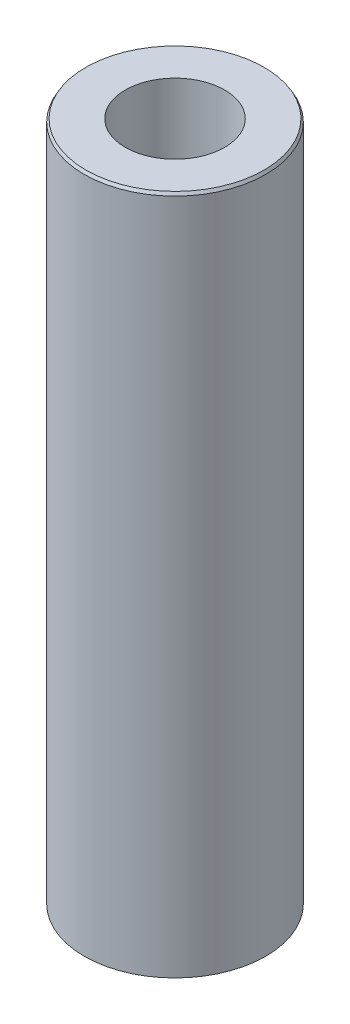
ISO-10303-21;
HEADER;
FILE_DESCRIPTION(('STEP AP214'),'2;1');
FILE_NAME('part.step','',(''),(''),'','','');
FILE_SCHEMA(('AUTOMOTIVE_DESIGN { 1 0 10303 214 1 1 1 1 }'));
ENDSEC;
DATA;
#1=APPLICATION_CONTEXT('core data for automotive mechanical design processes');
#2=APPLICATION_PROTOCOL_DEFINITION('international standard','automotive_design',2000,#1);
#3=PRODUCT_CONTEXT('',#1,'mechanical');
#4=PRODUCT('Part','Part','',(#3));
#5=PRODUCT_RELATED_PRODUCT_CATEGORY('part','',(#4));
#6=PRODUCT_DEFINITION_FORMATION('','',#4);
#7=PRODUCT_DEFINITION_CONTEXT('part definition',#1,'design');
#8=PRODUCT_DEFINITION('design','',#6,#7);
#9=PRODUCT_DEFINITION_SHAPE('','',#8);
#10=(LENGTH_UNIT() NAMED_UNIT(*) SI_UNIT(.MILLI.,.METRE.));
#11=(NAMED_UNIT(*) PLANE_ANGLE_UNIT() SI_UNIT($,.RADIAN.));
#12=(NAMED_UNIT(*) SI_UNIT($,.STERADIAN.) SOLID_ANGLE_UNIT());
#13=UNCERTAINTY_MEASURE_WITH_UNIT(LENGTH_MEASURE(1.E-05),#10,'distance_accuracy_value','');
#14=(GEOMETRIC_REPRESENTATION_CONTEXT(3) GLOBAL_UNCERTAINTY_ASSIGNED_CONTEXT((#13)) GLOBAL_UNIT_ASSIGNED_CONTEXT((#10,
#11,#12)) REPRESENTATION_CONTEXT('',''));
#15=CARTESIAN_POINT('',(0.,0.,0.));
#16=DIRECTION('',(0.,0.,1.));
#17=DIRECTION('',(1.,0.,0.));
#18=AXIS2_PLACEMENT_3D('',#15,#16,#17);
#19=CARTESIAN_POINT('',(0.,431.863019669284,0.));
#20=DIRECTION('',(0.,-1.,0.));
#21=DIRECTION('',(0.,0.,-1.));
#22=AXIS2_PLACEMENT_3D('',#19,#20,#21);
#23=CYLINDRICAL_SURFACE('',#22,57.5);
#24=CARTESIAN_POINT('',(0.,430.019896958542,0.));
#25=DIRECTION('',(0.,1.,0.));
#26=DIRECTION('',(0.,0.,1.));
#27=AXIS2_PLACEMENT_3D('',#24,#25,#26);
#28=CIRCLE('',#27,57.5);
#29=CARTESIAN_POINT('',(0.,430.019896958542,57.5));
#30=VERTEX_POINT('',#29);
#31=EDGE_CURVE('E50',#30,#30,#28,.F.);
#32=ORIENTED_EDGE('',*,*,#31,.T.);
#33=EDGE_LOOP('',(#32));
#34=FACE_BOUND('',#33,.T.);
#35=CARTESIAN_POINT('',(0.,1.0641273931965,0.));
#36=DIRECTION('',(0.,1.,0.));
#37=DIRECTION('',(0.,0.,1.));
#38=AXIS2_PLACEMENT_3D('',#35,#36,#37);
#39=CIRCLE('',#38,57.5);
#40=CARTESIAN_POINT('',(0.,1.0641273931965,57.5));
#41=VERTEX_POINT('',#40);
#42=EDGE_CURVE('E51',#41,#41,#39,.T.);
#43=ORIENTED_EDGE('',*,*,#42,.T.);
#44=EDGE_LOOP('',(#43));
#45=FACE_BOUND('',#44,.T.);
#46=ADVANCED_FACE('F39',(#34,#45),#23,.T.);
#47=CARTESIAN_POINT('',(0.,431.863019669284,0.));
#48=DIRECTION('',(0.,1.,0.));
#49=DIRECTION('',(0.,0.,1.));
#50=AXIS2_PLACEMENT_3D('',#47,#48,#49);
#51=PLANE('',#50);
#52=CARTESIAN_POINT('',(0.,431.863019669284,0.));
#53=DIRECTION('',(0.,1.,0.));
#54=DIRECTION('',(0.,0.,1.));
#55=AXIS2_PLACEMENT_3D('',#52,#53,#54);
#56=CIRCLE('',#55,56.4358726068035);
#57=CARTESIAN_POINT('',(0.,431.863019669284,56.4358726068035));
#58=VERTEX_POINT('',#57);
#59=EDGE_CURVE('E54',#58,#58,#56,.T.);
#60=ORIENTED_EDGE('',*,*,#59,.T.);
#61=EDGE_LOOP('',(#60));
#62=FACE_BOUND('',#61,.T.);
#63=CARTESIAN_POINT('',(0.,431.863019669284,0.));
#64=DIRECTION('',(0.,1.,0.));
#65=DIRECTION('',(0.,0.,1.));
#66=AXIS2_PLACEMENT_3D('',#63,#64,#65);
#67=CIRCLE('',#66,31.4998753711991);
#68=CARTESIAN_POINT('',(0.,431.863019669284,31.4998753711991));
#69=VERTEX_POINT('',#68);
#70=EDGE_CURVE('E58',#69,#69,#67,.T.);
#71=ORIENTED_EDGE('',*,*,#70,.F.);
#72=EDGE_LOOP('',(#71));
#73=FACE_BOUND('',#72,.T.);
#74=ADVANCED_FACE('F69',(#62,#73),#51,.T.);
#75=CARTESIAN_POINT('',(0.,0.,0.));
#76=DIRECTION('',(0.,1.,0.));
#77=DIRECTION('',(0.,0.,1.));
#78=AXIS2_PLACEMENT_3D('',#75,#76,#77);
#79=PLANE('',#78);
#80=CARTESIAN_POINT('',(0.,0.,0.));
#81=DIRECTION('',(0.,1.,0.));
#82=DIRECTION('',(0.,0.,1.));
#83=AXIS2_PLACEMENT_3D('',#80,#81,#82);
#84=CIRCLE('',#83,55.6568772892578);
#85=CARTESIAN_POINT('',(0.,0.,55.6568772892578));
#86=VERTEX_POINT('',#85);
#87=EDGE_CURVE('E10',#86,#86,#84,.F.);
#88=ORIENTED_EDGE('',*,*,#87,.T.);
#89=EDGE_LOOP('',(#88));
#90=FACE_BOUND('',#89,.T.);
#91=CARTESIAN_POINT('',(0.,0.,0.));
#92=DIRECTION('',(0.,1.,0.));
#93=DIRECTION('',(0.,0.,1.));
#94=AXIS2_PLACEMENT_3D('',#91,#92,#93);
#95=CIRCLE('',#94,31.4998753711991);
#96=CARTESIAN_POINT('',(0.,0.,31.4998753711991));
#97=VERTEX_POINT('',#96);
#98=EDGE_CURVE('E63',#97,#97,#95,.T.);
#99=ORIENTED_EDGE('',*,*,#98,.T.);
#100=EDGE_LOOP('',(#99));
#101=FACE_BOUND('',#100,.T.);
#102=ADVANCED_FACE('F75',(#90,#101),#79,.F.);
#103=CARTESIAN_POINT('',(0.,431.863019669284,0.));
#104=DIRECTION('',(0.,-1.,0.));
#105=DIRECTION('',(0.,0.,-1.));
#106=AXIS2_PLACEMENT_3D('',#103,#104,#105);
#107=CYLINDRICAL_SURFACE('',#106,31.4998753711991);
#108=ORIENTED_EDGE('',*,*,#70,.T.);
#109=EDGE_LOOP('',(#108));
#110=FACE_BOUND('',#109,.T.);
#111=ORIENTED_EDGE('',*,*,#98,.F.);
#112=EDGE_LOOP('',(#111));
#113=FACE_BOUND('',#112,.T.);
#114=ADVANCED_FACE('F70',(#110,#113),#107,.F.);
#115=CARTESIAN_POINT('',(0.,431.863019669284,0.));
#116=DIRECTION('',(0.,-1.,0.));
#117=DIRECTION('',(0.,0.,-1.));
#118=AXIS2_PLACEMENT_3D('',#115,#116,#117);
#119=CONICAL_SURFACE('',#118,56.4358726068035,0.523598775598291);
#120=ORIENTED_EDGE('',*,*,#31,.F.);
#121=EDGE_LOOP('',(#120));
#122=FACE_BOUND('',#121,.T.);
#123=ORIENTED_EDGE('',*,*,#59,.F.);
#124=EDGE_LOOP('',(#123));
#125=FACE_BOUND('',#124,.T.);
#126=ADVANCED_FACE('F81',(#122,#125),#119,.T.);
#127=CARTESIAN_POINT('',(0.,1.0641273931965,0.));
#128=DIRECTION('',(0.,1.,0.));
#129=DIRECTION('',(0.,0.,1.));
#130=AXIS2_PLACEMENT_3D('',#127,#128,#129);
#131=CONICAL_SURFACE('',#130,57.5,1.0471975511966);
#132=CARTESIAN_POINT('',(0.,0.,55.6568772892578));
#133=CARTESIAN_POINT('',(0.,0.0110846603457982,55.6760764841614));
#134=CARTESIAN_POINT('',(0.,0.0221693206915946,55.695275679065));
#135=CARTESIAN_POINT('',(0.,0.0443386413831873,55.7336740688721));
#136=CARTESIAN_POINT('',(0.,0.0554233017289837,55.7528732637757));
#137=CARTESIAN_POINT('',(0.,0.0775926224205776,55.7912716535828));
#138=CARTESIAN_POINT('',(0.,0.0886772827663751,55.8104708484863));
#139=CARTESIAN_POINT('',(0.,0.110846603457969,55.8488692382935));
#140=CARTESIAN_POINT('',(0.,0.121931263803766,55.868068433197));
#141=CARTESIAN_POINT('',(0.,0.144100584495359,55.9064668230042));
#142=CARTESIAN_POINT('',(0.,0.155185244841155,55.9256660179077));
#143=CARTESIAN_POINT('',(0.,0.17735456553275,55.9640644077149));
#144=CARTESIAN_POINT('',(0.,0.188439225878547,55.9832636026184));
#145=CARTESIAN_POINT('',(0.,0.210608546570141,56.0216619924255));
#146=CARTESIAN_POINT('',(0.,0.221693206915937,56.0408611873291));
#147=CARTESIAN_POINT('',(0.,0.243862527607531,56.0792595771362));
#148=CARTESIAN_POINT('',(0.,0.254947187953329,56.0984587720398));
#149=CARTESIAN_POINT('',(0.,0.277116508644922,56.1368571618469));
#150=CARTESIAN_POINT('',(0.,0.288201168990718,56.1560563567505));
#151=CARTESIAN_POINT('',(0.,0.310370489682312,56.1944547465576));
#152=CARTESIAN_POINT('',(0.,0.32145515002811,56.2136539414612));
#153=CARTESIAN_POINT('',(0.,0.343624470719704,56.2520523312683));
#154=CARTESIAN_POINT('',(0.,0.3547091310655,56.2712515261719));
#155=CARTESIAN_POINT('',(0.,0.376878451757094,56.309649915979));
#156=CARTESIAN_POINT('',(0.,0.387963112102891,56.3288491108826));
#157=CARTESIAN_POINT('',(0.,0.410132432794485,56.3672475006897));
#158=CARTESIAN_POINT('',(0.,0.421217093140281,56.3864466955933));
#159=CARTESIAN_POINT('',(0.,0.443386413831875,56.4248450854004));
#160=CARTESIAN_POINT('',(0.,0.454471074177673,56.444044280304));
#161=CARTESIAN_POINT('',(0.,0.476640394869267,56.4824426701111));
#162=CARTESIAN_POINT('',(0.,0.487725055215062,56.5016418650147));
#163=CARTESIAN_POINT('',(0.,0.509894375906656,56.5400402548218));
#164=CARTESIAN_POINT('',(0.,0.520979036252454,56.5592394497254));
#165=CARTESIAN_POINT('',(0.,0.543148356944048,56.5976378395325));
#166=CARTESIAN_POINT('',(0.,0.554233017289845,56.616837034436));
#167=CARTESIAN_POINT('',(0.,0.576402337981438,56.6552354242432));
#168=CARTESIAN_POINT('',(0.,0.587486998327234,56.6744346191467));
#169=CARTESIAN_POINT('',(0.,0.609656319018828,56.7128330089539));
#170=CARTESIAN_POINT('',(0.,0.620740979364626,56.7320322038574));
#171=CARTESIAN_POINT('',(0.,0.64291030005622,56.7704305936646));
#172=CARTESIAN_POINT('',(0.,0.653994960402016,56.7896297885681));
#173=CARTESIAN_POINT('',(0.,0.676164281093609,56.8280281783753));
#174=CARTESIAN_POINT('',(0.,0.687248941439407,56.8472273732788));
#175=CARTESIAN_POINT('',(0.,0.709418262131001,56.8856257630859));
#176=CARTESIAN_POINT('',(0.,0.720502922476797,56.9048249579895));
#177=CARTESIAN_POINT('',(0.,0.742672243168391,56.9432233477966));
#178=CARTESIAN_POINT('',(0.,0.753756903514189,56.9624225427002));
#179=CARTESIAN_POINT('',(0.,0.775926224205783,57.0008209325073));
#180=CARTESIAN_POINT('',(0.,0.787010884551579,57.0200201274109));
#181=CARTESIAN_POINT('',(0.,0.809180205243172,57.058418517218));
#182=CARTESIAN_POINT('',(0.,0.82026486558897,57.0776177121216));
#183=CARTESIAN_POINT('',(0.,0.842434186280564,57.1160161019287));
#184=CARTESIAN_POINT('',(0.,0.85351884662636,57.1352152968323));
#185=CARTESIAN_POINT('',(0.,0.875688167317953,57.1736136866394));
#186=CARTESIAN_POINT('',(0.,0.886772827663751,57.192812881543));
#187=CARTESIAN_POINT('',(0.,0.908942148355345,57.2312112713501));
#188=CARTESIAN_POINT('',(0.,0.920026808701141,57.2504104662537));
#189=CARTESIAN_POINT('',(0.,0.942196129392735,57.2888088560608));
#190=CARTESIAN_POINT('',(0.,0.953280789738533,57.3080080509644));
#191=CARTESIAN_POINT('',(0.,0.975450110430127,57.3464064407715));
#192=CARTESIAN_POINT('',(0.,0.986534770775923,57.3656056356751));
#193=CARTESIAN_POINT('',(0.,1.00870409146752,57.4040040254822));
#194=CARTESIAN_POINT('',(0.,1.01978875181331,57.4232032203857));
#195=CARTESIAN_POINT('',(0.,1.04195807250491,57.4616016101929));
#196=CARTESIAN_POINT('',(0.,1.05304273285071,57.4808008050964));
#197=CARTESIAN_POINT('',(0.,1.0641273931965,57.5));
#198=B_SPLINE_CURVE_WITH_KNOTS('',3,(#132,#133,#134,#135,#136,#137,#138,#139,#140,#141,#142,
#143,#144,#145,#146,#147,#148,#149,#150,#151,#152,#153,#154,#155,#156,#157,#158,#159,#160,#161,
#162,#163,#164,#165,#166,#167,#168,#169,#170,#171,#172,#173,#174,#175,#176,#177,#178,#179,#180,
#181,#182,#183,#184,#185,#186,#187,#188,#189,#190,#191,#192,#193,#194,#195,#196,#197),
.UNSPECIFIED.,.F.,.F.,(4,2,2,2,2,2,2,2,2,2,2,2,2,2,2,2,2,2,2,2,2,2,2,2,2,2,2,2,2,2,2,2,4),(0.,
0.0665079620747783,0.133015924149563,0.199523886224341,0.266031848299125,0.332539810373909,
0.399047772448688,0.465555734523472,0.53206369659825,0.598571658673034,0.665079620747813,
0.731587582822597,0.798095544897375,0.86460350697216,0.931111469046938,0.997619431121722,
1.0641273931965,1.13063535527128,1.19714331734607,1.26365127942085,1.33015924149563,
1.39666720357041,1.46317516564519,1.52968312771997,1.59619108979476,1.66269905186954,
1.72920701394432,1.7957149760191,1.86222293809388,1.92873090016866,1.99523886224344,
2.06174682431822,2.12825478639301),.UNSPECIFIED.);
#199=EDGE_CURVE('BSEAM45',#86,#41,#198,.T.);
#200=ORIENTED_EDGE('',*,*,#87,.F.);
#201=ORIENTED_EDGE('',*,*,#42,.F.);
#202=ORIENTED_EDGE('',*,*,#199,.T.);
#203=ORIENTED_EDGE('',*,*,#199,.F.);
#204=EDGE_LOOP('',(#200,#202,#201,#203));
#205=FACE_BOUND('',#204,.T.);
#206=ADVANCED_FACE('F45',(#205),#131,.T.);
#207=CLOSED_SHELL('',(#46,#74,#102,#114,#126,#206));
#208=MANIFOLD_SOLID_BREP('B2',#207);
#209=ADVANCED_BREP_SHAPE_REPRESENTATION('',(#18,#208),#14);
#210=SHAPE_DEFINITION_REPRESENTATION(#9,#209);
ENDSEC;
END-ISO-10303-21;
